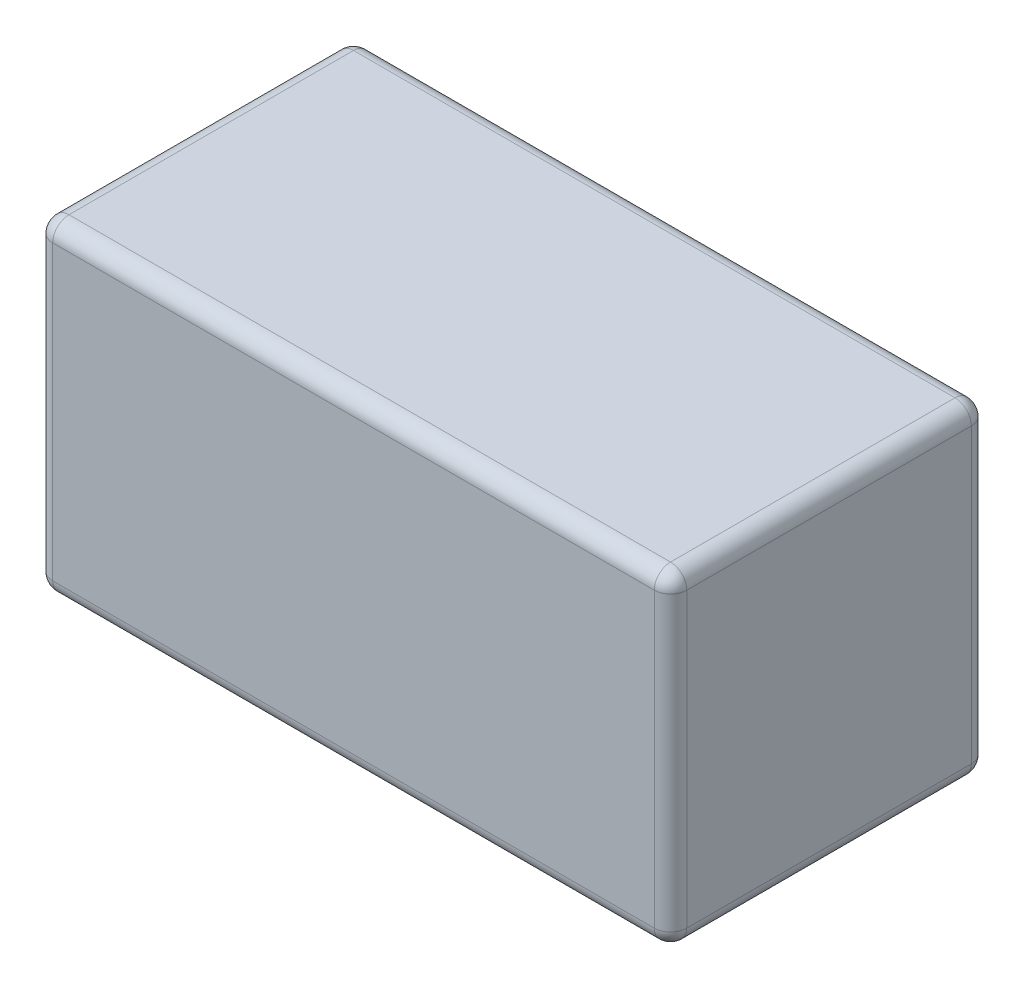
ISO-10303-21;
HEADER;
FILE_DESCRIPTION(('STEP AP214'),'2;1');
FILE_NAME('part.step','',(''),(''),'','','');
FILE_SCHEMA(('AUTOMOTIVE_DESIGN { 1 0 10303 214 1 1 1 1 }'));
ENDSEC;
DATA;
#1=APPLICATION_CONTEXT('core data for automotive mechanical design processes');
#2=APPLICATION_PROTOCOL_DEFINITION('international standard','automotive_design',2000,#1);
#3=PRODUCT_CONTEXT('',#1,'mechanical');
#4=PRODUCT('Part','Part','',(#3));
#5=PRODUCT_RELATED_PRODUCT_CATEGORY('part','',(#4));
#6=PRODUCT_DEFINITION_FORMATION('','',#4);
#7=PRODUCT_DEFINITION_CONTEXT('part definition',#1,'design');
#8=PRODUCT_DEFINITION('design','',#6,#7);
#9=PRODUCT_DEFINITION_SHAPE('','',#8);
#10=(LENGTH_UNIT() NAMED_UNIT(*) SI_UNIT(.MILLI.,.METRE.));
#11=(NAMED_UNIT(*) PLANE_ANGLE_UNIT() SI_UNIT($,.RADIAN.));
#12=(NAMED_UNIT(*) SI_UNIT($,.STERADIAN.) SOLID_ANGLE_UNIT());
#13=UNCERTAINTY_MEASURE_WITH_UNIT(LENGTH_MEASURE(1.E-05),#10,'distance_accuracy_value','');
#14=(GEOMETRIC_REPRESENTATION_CONTEXT(3) GLOBAL_UNCERTAINTY_ASSIGNED_CONTEXT((#13)) GLOBAL_UNIT_ASSIGNED_CONTEXT((#10,
#11,#12)) REPRESENTATION_CONTEXT('',''));
#15=CARTESIAN_POINT('',(0.,0.,0.));
#16=DIRECTION('',(0.,0.,1.));
#17=DIRECTION('',(1.,0.,0.));
#18=AXIS2_PLACEMENT_3D('',#15,#16,#17);
#19=CARTESIAN_POINT('',(39.,40.,-19.5));
#20=DIRECTION('',(-1.,0.,0.));
#21=DIRECTION('',(0.,0.,1.));
#22=AXIS2_PLACEMENT_3D('',#19,#20,#21);
#23=PLANE('',#22);
#24=DIRECTION('',(0.,0.,-1.));
#25=VECTOR('',#24,1.);
#26=CARTESIAN_POINT('',(39.,38.,19.5));
#27=LINE('',#26,#25);
#28=CARTESIAN_POINT('',(39.,38.,-17.5));
#29=VERTEX_POINT('',#28);
#30=CARTESIAN_POINT('',(39.,38.,17.5));
#31=VERTEX_POINT('',#30);
#32=EDGE_CURVE('E133',#29,#31,#27,.F.);
#33=ORIENTED_EDGE('',*,*,#32,.T.);
#34=DIRECTION('',(0.,-1.,0.));
#35=VECTOR('',#34,1.);
#36=CARTESIAN_POINT('',(39.,40.,17.5));
#37=LINE('',#36,#35);
#38=CARTESIAN_POINT('',(39.,2.,17.5));
#39=VERTEX_POINT('',#38);
#40=EDGE_CURVE('E129',#31,#39,#37,.T.);
#41=ORIENTED_EDGE('',*,*,#40,.T.);
#42=DIRECTION('',(0.,0.,-1.));
#43=VECTOR('',#42,1.);
#44=CARTESIAN_POINT('',(39.,2.,-19.5));
#45=LINE('',#44,#43);
#46=CARTESIAN_POINT('',(39.,2.,-17.5));
#47=VERTEX_POINT('',#46);
#48=EDGE_CURVE('E124',#39,#47,#45,.T.);
#49=ORIENTED_EDGE('',*,*,#48,.T.);
#50=DIRECTION('',(0.,-1.,0.));
#51=VECTOR('',#50,1.);
#52=CARTESIAN_POINT('',(39.,40.,-17.5));
#53=LINE('',#52,#51);
#54=EDGE_CURVE('E126',#47,#29,#53,.F.);
#55=ORIENTED_EDGE('',*,*,#54,.T.);
#56=EDGE_LOOP('',(#33,#41,#49,#55));
#57=FACE_BOUND('',#56,.T.);
#58=ADVANCED_FACE('F35',(#57),#23,.F.);
#59=CARTESIAN_POINT('',(-39.,40.,-19.5));
#60=DIRECTION('',(0.,0.,1.));
#61=DIRECTION('',(1.,0.,0.));
#62=AXIS2_PLACEMENT_3D('',#59,#60,#61);
#63=PLANE('',#62);
#64=DIRECTION('',(-1.,0.,0.));
#65=VECTOR('',#64,1.);
#66=CARTESIAN_POINT('',(39.,38.,-19.5));
#67=LINE('',#66,#65);
#68=CARTESIAN_POINT('',(-37.,38.,-19.5));
#69=VERTEX_POINT('',#68);
#70=CARTESIAN_POINT('',(37.,38.,-19.5));
#71=VERTEX_POINT('',#70);
#72=EDGE_CURVE('E44',#69,#71,#67,.F.);
#73=ORIENTED_EDGE('',*,*,#72,.T.);
#74=DIRECTION('',(0.,-1.,0.));
#75=VECTOR('',#74,1.);
#76=CARTESIAN_POINT('',(37.,40.,-19.5));
#77=LINE('',#76,#75);
#78=CARTESIAN_POINT('',(37.,2.,-19.5));
#79=VERTEX_POINT('',#78);
#80=EDGE_CURVE('E11',#71,#79,#77,.T.);
#81=ORIENTED_EDGE('',*,*,#80,.T.);
#82=DIRECTION('',(-1.,0.,0.));
#83=VECTOR('',#82,1.);
#84=CARTESIAN_POINT('',(-39.,2.,-19.5));
#85=LINE('',#84,#83);
#86=CARTESIAN_POINT('',(-37.,2.,-19.5));
#87=VERTEX_POINT('',#86);
#88=EDGE_CURVE('E221',#79,#87,#85,.T.);
#89=ORIENTED_EDGE('',*,*,#88,.T.);
#90=DIRECTION('',(0.,-1.,0.));
#91=VECTOR('',#90,1.);
#92=CARTESIAN_POINT('',(-37.,40.,-19.5));
#93=LINE('',#92,#91);
#94=EDGE_CURVE('E55',#87,#69,#93,.F.);
#95=ORIENTED_EDGE('',*,*,#94,.T.);
#96=EDGE_LOOP('',(#73,#81,#89,#95));
#97=FACE_BOUND('',#96,.T.);
#98=ADVANCED_FACE('F320',(#97),#63,.F.);
#99=CARTESIAN_POINT('',(-39.,40.,-19.5));
#100=DIRECTION('',(1.,0.,0.));
#101=DIRECTION('',(0.,0.,-1.));
#102=AXIS2_PLACEMENT_3D('',#99,#100,#101);
#103=PLANE('',#102);
#104=DIRECTION('',(0.,0.,1.));
#105=VECTOR('',#104,1.);
#106=CARTESIAN_POINT('',(-39.,2.,-19.5));
#107=LINE('',#106,#105);
#108=CARTESIAN_POINT('',(-39.,2.,-17.5));
#109=VERTEX_POINT('',#108);
#110=CARTESIAN_POINT('',(-39.,2.,17.5));
#111=VERTEX_POINT('',#110);
#112=EDGE_CURVE('E281',#109,#111,#107,.T.);
#113=ORIENTED_EDGE('',*,*,#112,.T.);
#114=DIRECTION('',(0.,-1.,0.));
#115=VECTOR('',#114,1.);
#116=CARTESIAN_POINT('',(-39.,40.,17.5));
#117=LINE('',#116,#115);
#118=CARTESIAN_POINT('',(-39.,38.,17.5));
#119=VERTEX_POINT('',#118);
#120=EDGE_CURVE('E283',#111,#119,#117,.F.);
#121=ORIENTED_EDGE('',*,*,#120,.T.);
#122=DIRECTION('',(0.,0.,1.));
#123=VECTOR('',#122,1.);
#124=CARTESIAN_POINT('',(-39.,38.,-19.5));
#125=LINE('',#124,#123);
#126=CARTESIAN_POINT('',(-39.,38.,-17.5));
#127=VERTEX_POINT('',#126);
#128=EDGE_CURVE('E212',#119,#127,#125,.F.);
#129=ORIENTED_EDGE('',*,*,#128,.T.);
#130=DIRECTION('',(0.,-1.,0.));
#131=VECTOR('',#130,1.);
#132=CARTESIAN_POINT('',(-39.,40.,-17.5));
#133=LINE('',#132,#131);
#134=EDGE_CURVE('E278',#127,#109,#133,.T.);
#135=ORIENTED_EDGE('',*,*,#134,.T.);
#136=EDGE_LOOP('',(#113,#121,#129,#135));
#137=FACE_BOUND('',#136,.T.);
#138=ADVANCED_FACE('F324',(#137),#103,.F.);
#139=CARTESIAN_POINT('',(-39.,40.,19.5));
#140=DIRECTION('',(0.,0.,-1.));
#141=DIRECTION('',(-1.,0.,0.));
#142=AXIS2_PLACEMENT_3D('',#139,#140,#141);
#143=PLANE('',#142);
#144=DIRECTION('',(1.,0.,0.));
#145=VECTOR('',#144,1.);
#146=CARTESIAN_POINT('',(-39.,2.,19.5));
#147=LINE('',#146,#145);
#148=CARTESIAN_POINT('',(-37.,2.,19.5));
#149=VERTEX_POINT('',#148);
#150=CARTESIAN_POINT('',(37.,2.,19.5));
#151=VERTEX_POINT('',#150);
#152=EDGE_CURVE('E262',#149,#151,#147,.T.);
#153=ORIENTED_EDGE('',*,*,#152,.T.);
#154=DIRECTION('',(0.,-1.,0.));
#155=VECTOR('',#154,1.);
#156=CARTESIAN_POINT('',(37.,40.,19.5));
#157=LINE('',#156,#155);
#158=CARTESIAN_POINT('',(37.,38.,19.5));
#159=VERTEX_POINT('',#158);
#160=EDGE_CURVE('E259',#151,#159,#157,.F.);
#161=ORIENTED_EDGE('',*,*,#160,.T.);
#162=DIRECTION('',(1.,0.,0.));
#163=VECTOR('',#162,1.);
#164=CARTESIAN_POINT('',(-39.,38.,19.5));
#165=LINE('',#164,#163);
#166=CARTESIAN_POINT('',(-37.,38.,19.5));
#167=VERTEX_POINT('',#166);
#168=EDGE_CURVE('E251',#159,#167,#165,.F.);
#169=ORIENTED_EDGE('',*,*,#168,.T.);
#170=DIRECTION('',(0.,-1.,0.));
#171=VECTOR('',#170,1.);
#172=CARTESIAN_POINT('',(-37.,40.,19.5));
#173=LINE('',#172,#171);
#174=EDGE_CURVE('E256',#167,#149,#173,.T.);
#175=ORIENTED_EDGE('',*,*,#174,.T.);
#176=EDGE_LOOP('',(#153,#161,#169,#175));
#177=FACE_BOUND('',#176,.T.);
#178=ADVANCED_FACE('F260',(#177),#143,.F.);
#179=CARTESIAN_POINT('',(0.,40.,0.));
#180=DIRECTION('',(0.,1.,0.));
#181=DIRECTION('',(0.,0.,1.));
#182=AXIS2_PLACEMENT_3D('',#179,#180,#181);
#183=PLANE('',#182);
#184=DIRECTION('',(0.,0.,1.));
#185=VECTOR('',#184,1.);
#186=CARTESIAN_POINT('',(-37.,40.,19.5));
#187=LINE('',#186,#185);
#188=CARTESIAN_POINT('',(-37.,40.,-17.5));
#189=VERTEX_POINT('',#188);
#190=CARTESIAN_POINT('',(-37.,40.,17.5));
#191=VERTEX_POINT('',#190);
#192=EDGE_CURVE('E214',#189,#191,#187,.T.);
#193=ORIENTED_EDGE('',*,*,#192,.T.);
#194=DIRECTION('',(1.,0.,0.));
#195=VECTOR('',#194,1.);
#196=CARTESIAN_POINT('',(39.,40.,17.5));
#197=LINE('',#196,#195);
#198=CARTESIAN_POINT('',(37.,40.,17.5));
#199=VERTEX_POINT('',#198);
#200=EDGE_CURVE('E218',#191,#199,#197,.T.);
#201=ORIENTED_EDGE('',*,*,#200,.T.);
#202=DIRECTION('',(0.,0.,-1.));
#203=VECTOR('',#202,1.);
#204=CARTESIAN_POINT('',(37.,40.,-19.5));
#205=LINE('',#204,#203);
#206=CARTESIAN_POINT('',(37.,40.,-17.5));
#207=VERTEX_POINT('',#206);
#208=EDGE_CURVE('E219',#199,#207,#205,.T.);
#209=ORIENTED_EDGE('',*,*,#208,.T.);
#210=DIRECTION('',(-1.,0.,0.));
#211=VECTOR('',#210,1.);
#212=CARTESIAN_POINT('',(-39.,40.,-17.5));
#213=LINE('',#212,#211);
#214=EDGE_CURVE('E223',#207,#189,#213,.T.);
#215=ORIENTED_EDGE('',*,*,#214,.T.);
#216=EDGE_LOOP('',(#193,#201,#209,#215));
#217=FACE_BOUND('',#216,.T.);
#218=ADVANCED_FACE('F285',(#217),#183,.T.);
#219=CARTESIAN_POINT('',(0.,0.,0.));
#220=DIRECTION('',(0.,1.,0.));
#221=DIRECTION('',(0.,0.,1.));
#222=AXIS2_PLACEMENT_3D('',#219,#220,#221);
#223=PLANE('',#222);
#224=DIRECTION('',(0.,0.,-1.));
#225=VECTOR('',#224,1.);
#226=CARTESIAN_POINT('',(37.,0.,0.));
#227=LINE('',#226,#225);
#228=CARTESIAN_POINT('',(37.,0.,-17.5));
#229=VERTEX_POINT('',#228);
#230=CARTESIAN_POINT('',(37.,0.,17.5));
#231=VERTEX_POINT('',#230);
#232=EDGE_CURVE('E154',#229,#231,#227,.F.);
#233=ORIENTED_EDGE('',*,*,#232,.T.);
#234=DIRECTION('',(1.,0.,0.));
#235=VECTOR('',#234,1.);
#236=CARTESIAN_POINT('',(0.,0.,17.5));
#237=LINE('',#236,#235);
#238=CARTESIAN_POINT('',(-37.,0.,17.5));
#239=VERTEX_POINT('',#238);
#240=EDGE_CURVE('E275',#231,#239,#237,.F.);
#241=ORIENTED_EDGE('',*,*,#240,.T.);
#242=DIRECTION('',(0.,0.,1.));
#243=VECTOR('',#242,1.);
#244=CARTESIAN_POINT('',(-37.,0.,0.));
#245=LINE('',#244,#243);
#246=CARTESIAN_POINT('',(-37.,0.,-17.5));
#247=VERTEX_POINT('',#246);
#248=EDGE_CURVE('E268',#239,#247,#245,.F.);
#249=ORIENTED_EDGE('',*,*,#248,.T.);
#250=DIRECTION('',(-1.,0.,0.));
#251=VECTOR('',#250,1.);
#252=CARTESIAN_POINT('',(0.,0.,-17.5));
#253=LINE('',#252,#251);
#254=EDGE_CURVE('E266',#247,#229,#253,.F.);
#255=ORIENTED_EDGE('',*,*,#254,.T.);
#256=EDGE_LOOP('',(#233,#241,#249,#255));
#257=FACE_BOUND('',#256,.T.);
#258=ADVANCED_FACE('F332',(#257),#223,.F.);
#259=CARTESIAN_POINT('',(-37.,40.,-17.5));
#260=DIRECTION('',(0.,-1.,0.));
#261=DIRECTION('',(0.,0.,-1.));
#262=AXIS2_PLACEMENT_3D('',#259,#260,#261);
#263=CYLINDRICAL_SURFACE('',#262,2.);
#264=CARTESIAN_POINT('',(-37.,38.,-17.5));
#265=DIRECTION('',(0.,1.,0.));
#266=DIRECTION('',(0.,0.,1.));
#267=AXIS2_PLACEMENT_3D('',#264,#265,#266);
#268=CIRCLE('',#267,2.);
#269=EDGE_CURVE('E39',#69,#127,#268,.T.);
#270=ORIENTED_EDGE('',*,*,#269,.F.);
#271=ORIENTED_EDGE('',*,*,#94,.F.);
#272=CARTESIAN_POINT('',(-37.,2.,-17.5));
#273=DIRECTION('',(0.,-1.,0.));
#274=DIRECTION('',(0.,0.,-1.));
#275=AXIS2_PLACEMENT_3D('',#272,#273,#274);
#276=CIRCLE('',#275,2.);
#277=EDGE_CURVE('E194',#109,#87,#276,.T.);
#278=ORIENTED_EDGE('',*,*,#277,.F.);
#279=ORIENTED_EDGE('',*,*,#134,.F.);
#280=EDGE_LOOP('',(#270,#271,#278,#279));
#281=FACE_BOUND('',#280,.T.);
#282=ADVANCED_FACE('F37',(#281),#263,.T.);
#283=CARTESIAN_POINT('',(-37.,38.,-17.5));
#284=DIRECTION('',(-1.,0.,0.));
#285=DIRECTION('',(0.,0.,1.));
#286=AXIS2_PLACEMENT_3D('',#283,#284,#285);
#287=SPHERICAL_SURFACE('',#286,2.);
#288=CARTESIAN_POINT('',(-37.,38.,-17.5));
#289=DIRECTION('',(-1.,0.,0.));
#290=DIRECTION('',(0.,0.,1.));
#291=AXIS2_PLACEMENT_3D('',#288,#289,#290);
#292=CIRCLE('',#291,2.);
#293=EDGE_CURVE('E189',#69,#189,#292,.F.);
#294=ORIENTED_EDGE('',*,*,#293,.F.);
#295=ORIENTED_EDGE('',*,*,#269,.T.);
#296=CARTESIAN_POINT('',(-37.,38.,-17.5));
#297=DIRECTION('',(0.,0.,-1.));
#298=DIRECTION('',(-1.,0.,0.));
#299=AXIS2_PLACEMENT_3D('',#296,#297,#298);
#300=CIRCLE('',#299,2.);
#301=EDGE_CURVE('E192',#189,#127,#300,.F.);
#302=ORIENTED_EDGE('',*,*,#301,.F.);
#303=EDGE_LOOP('',(#294,#295,#302));
#304=FACE_BOUND('',#303,.T.);
#305=ADVANCED_FACE('F204',(#304),#287,.T.);
#306=CARTESIAN_POINT('',(-37.,2.,-17.5));
#307=DIRECTION('',(0.,0.,-1.));
#308=DIRECTION('',(0.,1.,0.));
#309=AXIS2_PLACEMENT_3D('',#306,#307,#308);
#310=SPHERICAL_SURFACE('',#309,2.);
#311=CARTESIAN_POINT('',(-37.,2.,-17.5));
#312=DIRECTION('',(0.,0.,-1.));
#313=DIRECTION('',(-1.,0.,0.));
#314=AXIS2_PLACEMENT_3D('',#311,#312,#313);
#315=CIRCLE('',#314,2.);
#316=EDGE_CURVE('E183',#109,#247,#315,.F.);
#317=ORIENTED_EDGE('',*,*,#316,.F.);
#318=ORIENTED_EDGE('',*,*,#277,.T.);
#319=CARTESIAN_POINT('',(-37.,2.,-17.5));
#320=DIRECTION('',(-1.,0.,0.));
#321=DIRECTION('',(0.,0.,1.));
#322=AXIS2_PLACEMENT_3D('',#319,#320,#321);
#323=CIRCLE('',#322,2.);
#324=EDGE_CURVE('E186',#247,#87,#323,.F.);
#325=ORIENTED_EDGE('',*,*,#324,.F.);
#326=EDGE_LOOP('',(#317,#318,#325));
#327=FACE_BOUND('',#326,.T.);
#328=ADVANCED_FACE('F358',(#327),#310,.T.);
#329=CARTESIAN_POINT('',(-37.,38.,0.));
#330=DIRECTION('',(0.,0.,-1.));
#331=DIRECTION('',(-1.,0.,0.));
#332=AXIS2_PLACEMENT_3D('',#329,#330,#331);
#333=CYLINDRICAL_SURFACE('',#332,2.);
#334=ORIENTED_EDGE('',*,*,#301,.T.);
#335=ORIENTED_EDGE('',*,*,#128,.F.);
#336=CARTESIAN_POINT('',(-37.,38.,17.5));
#337=DIRECTION('',(0.,0.,1.));
#338=DIRECTION('',(1.,0.,0.));
#339=AXIS2_PLACEMENT_3D('',#336,#337,#338);
#340=CIRCLE('',#339,2.);
#341=EDGE_CURVE('E178',#191,#119,#340,.T.);
#342=ORIENTED_EDGE('',*,*,#341,.F.);
#343=ORIENTED_EDGE('',*,*,#192,.F.);
#344=EDGE_LOOP('',(#334,#335,#342,#343));
#345=FACE_BOUND('',#344,.T.);
#346=ADVANCED_FACE('F210',(#345),#333,.T.);
#347=CARTESIAN_POINT('',(0.,38.,-17.5));
#348=DIRECTION('',(1.,0.,0.));
#349=DIRECTION('',(0.,0.,-1.));
#350=AXIS2_PLACEMENT_3D('',#347,#348,#349);
#351=CYLINDRICAL_SURFACE('',#350,2.);
#352=ORIENTED_EDGE('',*,*,#293,.T.);
#353=ORIENTED_EDGE('',*,*,#214,.F.);
#354=CARTESIAN_POINT('',(37.,38.,-17.5));
#355=DIRECTION('',(1.,0.,0.));
#356=DIRECTION('',(0.,0.,-1.));
#357=AXIS2_PLACEMENT_3D('',#354,#355,#356);
#358=CIRCLE('',#357,2.);
#359=EDGE_CURVE('E175',#71,#207,#358,.T.);
#360=ORIENTED_EDGE('',*,*,#359,.F.);
#361=ORIENTED_EDGE('',*,*,#72,.F.);
#362=EDGE_LOOP('',(#352,#353,#360,#361));
#363=FACE_BOUND('',#362,.T.);
#364=ADVANCED_FACE('F288',(#363),#351,.T.);
#365=CARTESIAN_POINT('',(37.,40.,-17.5));
#366=DIRECTION('',(0.,-1.,0.));
#367=DIRECTION('',(0.,0.,-1.));
#368=AXIS2_PLACEMENT_3D('',#365,#366,#367);
#369=CYLINDRICAL_SURFACE('',#368,2.);
#370=CARTESIAN_POINT('',(37.,2.,-17.5));
#371=DIRECTION('',(0.,-1.,0.));
#372=DIRECTION('',(0.,0.,-1.));
#373=AXIS2_PLACEMENT_3D('',#370,#371,#372);
#374=CIRCLE('',#373,2.);
#375=EDGE_CURVE('E139',#79,#47,#374,.T.);
#376=ORIENTED_EDGE('',*,*,#375,.F.);
#377=ORIENTED_EDGE('',*,*,#80,.F.);
#378=CARTESIAN_POINT('',(37.,38.,-17.5));
#379=DIRECTION('',(0.,1.,0.));
#380=DIRECTION('',(0.,0.,1.));
#381=AXIS2_PLACEMENT_3D('',#378,#379,#380);
#382=CIRCLE('',#381,2.);
#383=EDGE_CURVE('E142',#29,#71,#382,.T.);
#384=ORIENTED_EDGE('',*,*,#383,.F.);
#385=ORIENTED_EDGE('',*,*,#54,.F.);
#386=EDGE_LOOP('',(#376,#377,#384,#385));
#387=FACE_BOUND('',#386,.T.);
#388=ADVANCED_FACE('F138',(#387),#369,.T.);
#389=CARTESIAN_POINT('',(-39.,2.,-17.5));
#390=DIRECTION('',(-1.,0.,0.));
#391=DIRECTION('',(0.,0.,1.));
#392=AXIS2_PLACEMENT_3D('',#389,#390,#391);
#393=CYLINDRICAL_SURFACE('',#392,2.);
#394=ORIENTED_EDGE('',*,*,#324,.T.);
#395=ORIENTED_EDGE('',*,*,#88,.F.);
#396=CARTESIAN_POINT('',(37.,2.,-17.5));
#397=DIRECTION('',(1.,0.,0.));
#398=DIRECTION('',(0.,0.,-1.));
#399=AXIS2_PLACEMENT_3D('',#396,#397,#398);
#400=CIRCLE('',#399,2.);
#401=EDGE_CURVE('E151',#229,#79,#400,.T.);
#402=ORIENTED_EDGE('',*,*,#401,.F.);
#403=ORIENTED_EDGE('',*,*,#254,.F.);
#404=EDGE_LOOP('',(#394,#395,#402,#403));
#405=FACE_BOUND('',#404,.T.);
#406=ADVANCED_FACE('F383',(#405),#393,.T.);
#407=CARTESIAN_POINT('',(-37.,2.,-19.5));
#408=DIRECTION('',(0.,0.,1.));
#409=DIRECTION('',(1.,0.,0.));
#410=AXIS2_PLACEMENT_3D('',#407,#408,#409);
#411=CYLINDRICAL_SURFACE('',#410,2.);
#412=ORIENTED_EDGE('',*,*,#316,.T.);
#413=ORIENTED_EDGE('',*,*,#248,.F.);
#414=CARTESIAN_POINT('',(-37.,2.,17.5));
#415=DIRECTION('',(0.,0.,1.));
#416=DIRECTION('',(1.,0.,0.));
#417=AXIS2_PLACEMENT_3D('',#414,#415,#416);
#418=CIRCLE('',#417,2.);
#419=EDGE_CURVE('E170',#111,#239,#418,.T.);
#420=ORIENTED_EDGE('',*,*,#419,.F.);
#421=ORIENTED_EDGE('',*,*,#112,.F.);
#422=EDGE_LOOP('',(#412,#413,#420,#421));
#423=FACE_BOUND('',#422,.T.);
#424=ADVANCED_FACE('F392',(#423),#411,.T.);
#425=CARTESIAN_POINT('',(-37.,40.,17.5));
#426=DIRECTION('',(0.,-1.,0.));
#427=DIRECTION('',(0.,0.,-1.));
#428=AXIS2_PLACEMENT_3D('',#425,#426,#427);
#429=CYLINDRICAL_SURFACE('',#428,2.);
#430=CARTESIAN_POINT('',(-37.,38.,17.5));
#431=DIRECTION('',(0.,1.,0.));
#432=DIRECTION('',(0.,0.,1.));
#433=AXIS2_PLACEMENT_3D('',#430,#431,#432);
#434=CIRCLE('',#433,2.);
#435=EDGE_CURVE('E180',#119,#167,#434,.T.);
#436=ORIENTED_EDGE('',*,*,#435,.F.);
#437=ORIENTED_EDGE('',*,*,#120,.F.);
#438=CARTESIAN_POINT('',(-37.,2.,17.5));
#439=DIRECTION('',(0.,-1.,0.));
#440=DIRECTION('',(0.,0.,-1.));
#441=AXIS2_PLACEMENT_3D('',#438,#439,#440);
#442=CIRCLE('',#441,2.);
#443=EDGE_CURVE('E167',#149,#111,#442,.T.);
#444=ORIENTED_EDGE('',*,*,#443,.F.);
#445=ORIENTED_EDGE('',*,*,#174,.F.);
#446=EDGE_LOOP('',(#436,#437,#444,#445));
#447=FACE_BOUND('',#446,.T.);
#448=ADVANCED_FACE('F301',(#447),#429,.T.);
#449=CARTESIAN_POINT('',(-37.,38.,17.5));
#450=DIRECTION('',(-1.,0.,0.));
#451=DIRECTION('',(0.,0.,1.));
#452=AXIS2_PLACEMENT_3D('',#449,#450,#451);
#453=SPHERICAL_SURFACE('',#452,2.);
#454=ORIENTED_EDGE('',*,*,#341,.T.);
#455=ORIENTED_EDGE('',*,*,#435,.T.);
#456=CARTESIAN_POINT('',(-37.,38.,17.5));
#457=DIRECTION('',(-1.,0.,0.));
#458=DIRECTION('',(0.,0.,1.));
#459=AXIS2_PLACEMENT_3D('',#456,#457,#458);
#460=CIRCLE('',#459,2.);
#461=EDGE_CURVE('E159',#191,#167,#460,.F.);
#462=ORIENTED_EDGE('',*,*,#461,.F.);
#463=EDGE_LOOP('',(#454,#455,#462));
#464=FACE_BOUND('',#463,.T.);
#465=ADVANCED_FACE('F407',(#464),#453,.T.);
#466=CARTESIAN_POINT('',(37.,38.,-17.5));
#467=DIRECTION('',(0.,0.,-1.));
#468=DIRECTION('',(-1.,0.,0.));
#469=AXIS2_PLACEMENT_3D('',#466,#467,#468);
#470=SPHERICAL_SURFACE('',#469,2.);
#471=ORIENTED_EDGE('',*,*,#383,.T.);
#472=ORIENTED_EDGE('',*,*,#359,.T.);
#473=CARTESIAN_POINT('',(37.,38.,-17.5));
#474=DIRECTION('',(0.,0.,-1.));
#475=DIRECTION('',(-1.,0.,0.));
#476=AXIS2_PLACEMENT_3D('',#473,#474,#475);
#477=CIRCLE('',#476,2.);
#478=EDGE_CURVE('E155',#29,#207,#477,.F.);
#479=ORIENTED_EDGE('',*,*,#478,.F.);
#480=EDGE_LOOP('',(#471,#472,#479));
#481=FACE_BOUND('',#480,.T.);
#482=ADVANCED_FACE('F290',(#481),#470,.T.);
#483=CARTESIAN_POINT('',(37.,2.,-17.5));
#484=DIRECTION('',(0.,0.,-1.));
#485=DIRECTION('',(0.,1.,0.));
#486=AXIS2_PLACEMENT_3D('',#483,#484,#485);
#487=SPHERICAL_SURFACE('',#486,2.);
#488=ORIENTED_EDGE('',*,*,#401,.T.);
#489=ORIENTED_EDGE('',*,*,#375,.T.);
#490=CARTESIAN_POINT('',(37.,2.,-17.5));
#491=DIRECTION('',(0.,0.,-1.));
#492=DIRECTION('',(-1.,0.,0.));
#493=AXIS2_PLACEMENT_3D('',#490,#491,#492);
#494=CIRCLE('',#493,2.);
#495=EDGE_CURVE('E148',#229,#47,#494,.F.);
#496=ORIENTED_EDGE('',*,*,#495,.F.);
#497=EDGE_LOOP('',(#488,#489,#496));
#498=FACE_BOUND('',#497,.T.);
#499=ADVANCED_FACE('F147',(#498),#487,.T.);
#500=CARTESIAN_POINT('',(-37.,2.,17.5));
#501=DIRECTION('',(-1.,0.,0.));
#502=DIRECTION('',(0.,-1.,0.));
#503=AXIS2_PLACEMENT_3D('',#500,#501,#502);
#504=SPHERICAL_SURFACE('',#503,2.);
#505=ORIENTED_EDGE('',*,*,#443,.T.);
#506=ORIENTED_EDGE('',*,*,#419,.T.);
#507=CARTESIAN_POINT('',(-37.,2.,17.5));
#508=DIRECTION('',(-1.,0.,0.));
#509=DIRECTION('',(0.,0.,1.));
#510=AXIS2_PLACEMENT_3D('',#507,#508,#509);
#511=CIRCLE('',#510,2.);
#512=EDGE_CURVE('E156',#149,#239,#511,.F.);
#513=ORIENTED_EDGE('',*,*,#512,.F.);
#514=EDGE_LOOP('',(#505,#506,#513));
#515=FACE_BOUND('',#514,.T.);
#516=ADVANCED_FACE('F304',(#515),#504,.T.);
#517=CARTESIAN_POINT('',(0.,38.,17.5));
#518=DIRECTION('',(-1.,0.,0.));
#519=DIRECTION('',(0.,0.,1.));
#520=AXIS2_PLACEMENT_3D('',#517,#518,#519);
#521=CYLINDRICAL_SURFACE('',#520,2.);
#522=ORIENTED_EDGE('',*,*,#461,.T.);
#523=ORIENTED_EDGE('',*,*,#168,.F.);
#524=CARTESIAN_POINT('',(37.,38.,17.5));
#525=DIRECTION('',(1.,0.,0.));
#526=DIRECTION('',(0.,0.,-1.));
#527=AXIS2_PLACEMENT_3D('',#524,#525,#526);
#528=CIRCLE('',#527,2.);
#529=EDGE_CURVE('E161',#199,#159,#528,.T.);
#530=ORIENTED_EDGE('',*,*,#529,.F.);
#531=ORIENTED_EDGE('',*,*,#200,.F.);
#532=EDGE_LOOP('',(#522,#523,#530,#531));
#533=FACE_BOUND('',#532,.T.);
#534=ADVANCED_FACE('F253',(#533),#521,.T.);
#535=CARTESIAN_POINT('',(37.,38.,0.));
#536=DIRECTION('',(0.,0.,1.));
#537=DIRECTION('',(1.,0.,0.));
#538=AXIS2_PLACEMENT_3D('',#535,#536,#537);
#539=CYLINDRICAL_SURFACE('',#538,2.);
#540=ORIENTED_EDGE('',*,*,#478,.T.);
#541=ORIENTED_EDGE('',*,*,#208,.F.);
#542=CARTESIAN_POINT('',(37.,38.,17.5));
#543=DIRECTION('',(0.,0.,1.));
#544=DIRECTION('',(0.,-1.,0.));
#545=AXIS2_PLACEMENT_3D('',#542,#543,#544);
#546=CIRCLE('',#545,2.);
#547=EDGE_CURVE('E240',#31,#199,#546,.T.);
#548=ORIENTED_EDGE('',*,*,#547,.F.);
#549=ORIENTED_EDGE('',*,*,#32,.F.);
#550=EDGE_LOOP('',(#540,#541,#548,#549));
#551=FACE_BOUND('',#550,.T.);
#552=ADVANCED_FACE('F293',(#551),#539,.T.);
#553=CARTESIAN_POINT('',(37.,2.,-19.5));
#554=DIRECTION('',(0.,0.,-1.));
#555=DIRECTION('',(-1.,0.,0.));
#556=AXIS2_PLACEMENT_3D('',#553,#554,#555);
#557=CYLINDRICAL_SURFACE('',#556,2.);
#558=ORIENTED_EDGE('',*,*,#495,.T.);
#559=ORIENTED_EDGE('',*,*,#48,.F.);
#560=CARTESIAN_POINT('',(37.,2.,17.5));
#561=DIRECTION('',(0.,0.,1.));
#562=DIRECTION('',(1.,0.,0.));
#563=AXIS2_PLACEMENT_3D('',#560,#561,#562);
#564=CIRCLE('',#563,2.);
#565=EDGE_CURVE('E237',#231,#39,#564,.T.);
#566=ORIENTED_EDGE('',*,*,#565,.F.);
#567=ORIENTED_EDGE('',*,*,#232,.F.);
#568=EDGE_LOOP('',(#558,#559,#566,#567));
#569=FACE_BOUND('',#568,.T.);
#570=ADVANCED_FACE('F153',(#569),#557,.T.);
#571=CARTESIAN_POINT('',(-39.,2.,17.5));
#572=DIRECTION('',(1.,0.,0.));
#573=DIRECTION('',(0.,0.,-1.));
#574=AXIS2_PLACEMENT_3D('',#571,#572,#573);
#575=CYLINDRICAL_SURFACE('',#574,2.);
#576=ORIENTED_EDGE('',*,*,#512,.T.);
#577=ORIENTED_EDGE('',*,*,#240,.F.);
#578=CARTESIAN_POINT('',(37.,2.,17.5));
#579=DIRECTION('',(1.,0.,0.));
#580=DIRECTION('',(0.,0.,-1.));
#581=AXIS2_PLACEMENT_3D('',#578,#579,#580);
#582=CIRCLE('',#581,2.);
#583=EDGE_CURVE('E234',#151,#231,#582,.T.);
#584=ORIENTED_EDGE('',*,*,#583,.F.);
#585=ORIENTED_EDGE('',*,*,#152,.F.);
#586=EDGE_LOOP('',(#576,#577,#584,#585));
#587=FACE_BOUND('',#586,.T.);
#588=ADVANCED_FACE('F308',(#587),#575,.T.);
#589=CARTESIAN_POINT('',(37.,38.,17.5));
#590=DIRECTION('',(0.,1.,0.));
#591=DIRECTION('',(0.,0.,1.));
#592=AXIS2_PLACEMENT_3D('',#589,#590,#591);
#593=SPHERICAL_SURFACE('',#592,2.);
#594=ORIENTED_EDGE('',*,*,#547,.T.);
#595=ORIENTED_EDGE('',*,*,#529,.T.);
#596=CARTESIAN_POINT('',(37.,38.,17.5));
#597=DIRECTION('',(0.,1.,0.));
#598=DIRECTION('',(0.,0.,1.));
#599=AXIS2_PLACEMENT_3D('',#596,#597,#598);
#600=CIRCLE('',#599,2.);
#601=EDGE_CURVE('E232',#31,#159,#600,.F.);
#602=ORIENTED_EDGE('',*,*,#601,.F.);
#603=EDGE_LOOP('',(#594,#595,#602));
#604=FACE_BOUND('',#603,.T.);
#605=ADVANCED_FACE('F246',(#604),#593,.T.);
#606=CARTESIAN_POINT('',(37.,2.,17.5));
#607=DIRECTION('',(0.,-1.,0.));
#608=DIRECTION('',(0.,0.,-1.));
#609=AXIS2_PLACEMENT_3D('',#606,#607,#608);
#610=SPHERICAL_SURFACE('',#609,2.);
#611=ORIENTED_EDGE('',*,*,#583,.T.);
#612=ORIENTED_EDGE('',*,*,#565,.T.);
#613=CARTESIAN_POINT('',(37.,2.,17.5));
#614=DIRECTION('',(0.,-1.,0.));
#615=DIRECTION('',(0.,0.,-1.));
#616=AXIS2_PLACEMENT_3D('',#613,#614,#615);
#617=CIRCLE('',#616,2.);
#618=EDGE_CURVE('E230',#151,#39,#617,.F.);
#619=ORIENTED_EDGE('',*,*,#618,.F.);
#620=EDGE_LOOP('',(#611,#612,#619));
#621=FACE_BOUND('',#620,.T.);
#622=ADVANCED_FACE('F310',(#621),#610,.T.);
#623=CARTESIAN_POINT('',(37.,40.,17.5));
#624=DIRECTION('',(0.,-1.,0.));
#625=DIRECTION('',(0.,0.,-1.));
#626=AXIS2_PLACEMENT_3D('',#623,#624,#625);
#627=CYLINDRICAL_SURFACE('',#626,2.);
#628=ORIENTED_EDGE('',*,*,#601,.T.);
#629=ORIENTED_EDGE('',*,*,#160,.F.);
#630=ORIENTED_EDGE('',*,*,#618,.T.);
#631=ORIENTED_EDGE('',*,*,#40,.F.);
#632=EDGE_LOOP('',(#628,#629,#630,#631));
#633=FACE_BOUND('',#632,.T.);
#634=ADVANCED_FACE('F311',(#633),#627,.T.);
#635=CLOSED_SHELL('',(#58,#98,#138,#178,#218,#258,#282,#305,#328,#346,#364,#388,#406,#424,#448,
#465,#482,#499,#516,#534,#552,#570,#588,#605,#622,#634));
#636=MANIFOLD_SOLID_BREP('B2',#635);
#637=ADVANCED_BREP_SHAPE_REPRESENTATION('',(#18,#636),#14);
#638=SHAPE_DEFINITION_REPRESENTATION(#9,#637);
ENDSEC;
END-ISO-10303-21;
